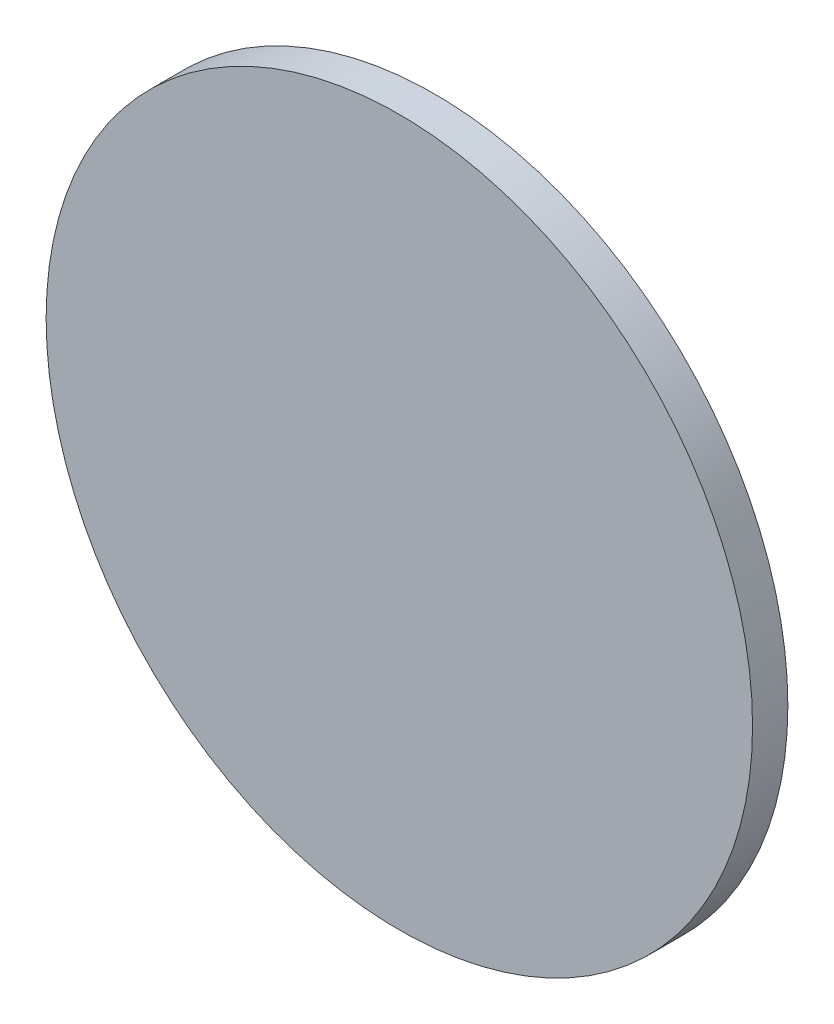
ISO-10303-21;
HEADER;
FILE_DESCRIPTION(('STEP AP214'),'2;1');
FILE_NAME('part.step','',(''),(''),'','','');
FILE_SCHEMA(('AUTOMOTIVE_DESIGN { 1 0 10303 214 1 1 1 1 }'));
ENDSEC;
DATA;
#1=APPLICATION_CONTEXT('core data for automotive mechanical design processes');
#2=APPLICATION_PROTOCOL_DEFINITION('international standard','automotive_design',2000,#1);
#3=PRODUCT_CONTEXT('',#1,'mechanical');
#4=PRODUCT('Part','Part','',(#3));
#5=PRODUCT_RELATED_PRODUCT_CATEGORY('part','',(#4));
#6=PRODUCT_DEFINITION_FORMATION('','',#4);
#7=PRODUCT_DEFINITION_CONTEXT('part definition',#1,'design');
#8=PRODUCT_DEFINITION('design','',#6,#7);
#9=PRODUCT_DEFINITION_SHAPE('','',#8);
#10=(LENGTH_UNIT() NAMED_UNIT(*) SI_UNIT(.MILLI.,.METRE.));
#11=(NAMED_UNIT(*) PLANE_ANGLE_UNIT() SI_UNIT($,.RADIAN.));
#12=(NAMED_UNIT(*) SI_UNIT($,.STERADIAN.) SOLID_ANGLE_UNIT());
#13=UNCERTAINTY_MEASURE_WITH_UNIT(LENGTH_MEASURE(1.E-05),#10,'distance_accuracy_value','');
#14=(GEOMETRIC_REPRESENTATION_CONTEXT(3) GLOBAL_UNCERTAINTY_ASSIGNED_CONTEXT((#13)) GLOBAL_UNIT_ASSIGNED_CONTEXT((#10,
#11,#12)) REPRESENTATION_CONTEXT('',''));
#15=CARTESIAN_POINT('',(0.,0.,0.));
#16=DIRECTION('',(0.,0.,1.));
#17=DIRECTION('',(1.,0.,0.));
#18=AXIS2_PLACEMENT_3D('',#15,#16,#17);
#19=CARTESIAN_POINT('',(0.0999998,0.,0.00999998));
#20=DIRECTION('',(0.,0.,-1.));
#21=DIRECTION('',(0.,-1.,0.));
#22=AXIS2_PLACEMENT_3D('',#19,#20,#21);
#23=PLANE('',#22);
#24=CARTESIAN_POINT('',(0.,0.,0.00999998));
#25=DIRECTION('',(0.,0.,1.));
#26=DIRECTION('',(1.,0.,0.));
#27=AXIS2_PLACEMENT_3D('',#24,#25,#26);
#28=CIRCLE('',#27,0.0999998);
#29=CARTESIAN_POINT('',(0.0999998,0.,0.00999998));
#30=VERTEX_POINT('',#29);
#31=EDGE_CURVE('E11',#30,#30,#28,.T.);
#32=ORIENTED_EDGE('',*,*,#31,.T.);
#33=EDGE_LOOP('',(#32));
#34=FACE_BOUND('',#33,.T.);
#35=ADVANCED_FACE('F16',(#34),#23,.F.);
#36=CARTESIAN_POINT('',(0.0999998,0.,0.));
#37=DIRECTION('',(0.,0.,-1.));
#38=DIRECTION('',(0.,-1.,0.));
#39=AXIS2_PLACEMENT_3D('',#36,#37,#38);
#40=PLANE('',#39);
#41=CARTESIAN_POINT('',(0.,0.,0.));
#42=DIRECTION('',(0.,0.,1.));
#43=DIRECTION('',(1.,0.,0.));
#44=AXIS2_PLACEMENT_3D('',#41,#42,#43);
#45=CIRCLE('',#44,0.0999998);
#46=CARTESIAN_POINT('',(0.0999998,0.,0.));
#47=VERTEX_POINT('',#46);
#48=EDGE_CURVE('E19',#47,#47,#45,.T.);
#49=ORIENTED_EDGE('',*,*,#48,.F.);
#50=EDGE_LOOP('',(#49));
#51=FACE_BOUND('',#50,.T.);
#52=ADVANCED_FACE('F51',(#51),#40,.T.);
#53=CARTESIAN_POINT('',(0.,0.,0.));
#54=DIRECTION('',(0.,0.,-1.));
#55=DIRECTION('',(1.,0.,0.));
#56=AXIS2_PLACEMENT_3D('',#53,#54,#55);
#57=CYLINDRICAL_SURFACE('',#56,0.0999998);
#58=ORIENTED_EDGE('',*,*,#48,.T.);
#59=DIRECTION('',(0.,0.,1.));
#60=VECTOR('',#59,1.);
#61=CARTESIAN_POINT('',(0.0999998,0.,0.));
#62=LINE('',#61,#60);
#63=EDGE_CURVE('E26',#47,#30,#62,.T.);
#64=ORIENTED_EDGE('',*,*,#63,.T.);
#65=ORIENTED_EDGE('',*,*,#31,.F.);
#66=ORIENTED_EDGE('',*,*,#63,.F.);
#67=EDGE_LOOP('',(#58,#64,#65,#66));
#68=FACE_BOUND('',#67,.T.);
#69=ADVANCED_FACE('F40',(#68),#57,.T.);
#70=CLOSED_SHELL('',(#35,#52,#69));
#71=MANIFOLD_SOLID_BREP('B1',#70);
#72=ADVANCED_BREP_SHAPE_REPRESENTATION('',(#18,#71),#14);
#73=SHAPE_DEFINITION_REPRESENTATION(#9,#72);
ENDSEC;
END-ISO-10303-21;
